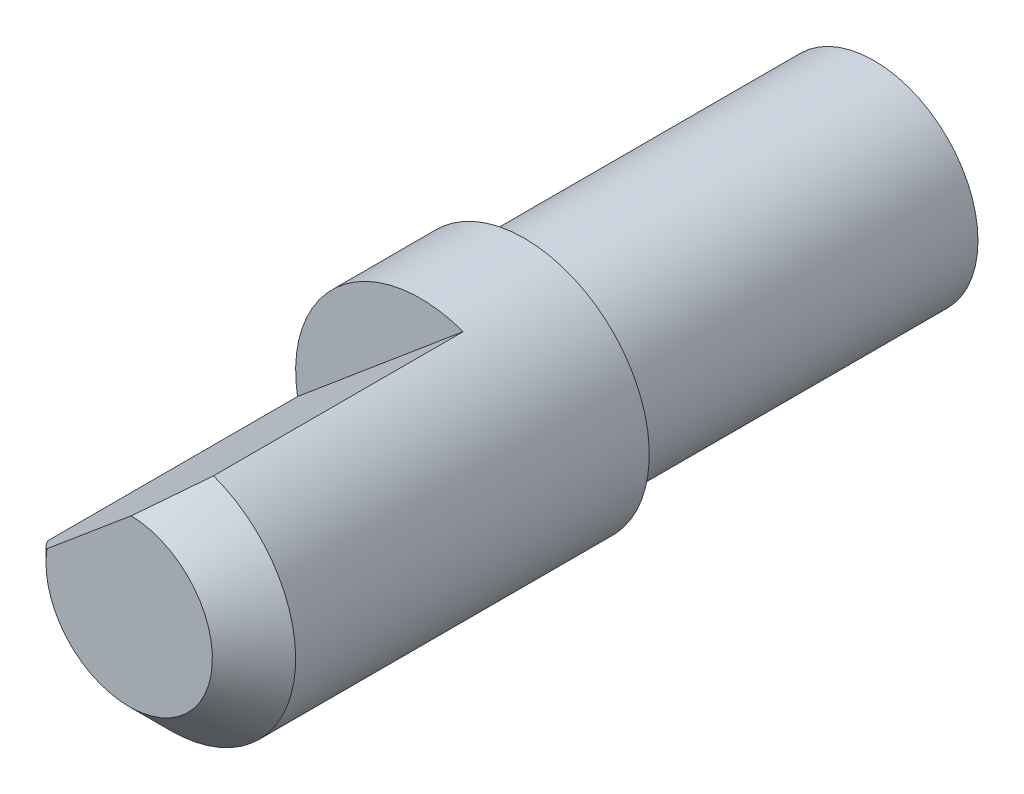
ISO-10303-21;
HEADER;
FILE_DESCRIPTION(('STEP AP214'),'2;1');
FILE_NAME('part.step','',(''),(''),'','','');
FILE_SCHEMA(('AUTOMOTIVE_DESIGN { 1 0 10303 214 1 1 1 1 }'));
ENDSEC;
DATA;
#1=APPLICATION_CONTEXT('core data for automotive mechanical design processes');
#2=APPLICATION_PROTOCOL_DEFINITION('international standard','automotive_design',2000,#1);
#3=PRODUCT_CONTEXT('',#1,'mechanical');
#4=PRODUCT('Part','Part','',(#3));
#5=PRODUCT_RELATED_PRODUCT_CATEGORY('part','',(#4));
#6=PRODUCT_DEFINITION_FORMATION('','',#4);
#7=PRODUCT_DEFINITION_CONTEXT('part definition',#1,'design');
#8=PRODUCT_DEFINITION('design','',#6,#7);
#9=PRODUCT_DEFINITION_SHAPE('','',#8);
#10=(LENGTH_UNIT() NAMED_UNIT(*) SI_UNIT(.MILLI.,.METRE.));
#11=(NAMED_UNIT(*) PLANE_ANGLE_UNIT() SI_UNIT($,.RADIAN.));
#12=(NAMED_UNIT(*) SI_UNIT($,.STERADIAN.) SOLID_ANGLE_UNIT());
#13=UNCERTAINTY_MEASURE_WITH_UNIT(LENGTH_MEASURE(1.E-05),#10,'distance_accuracy_value','');
#14=(GEOMETRIC_REPRESENTATION_CONTEXT(3) GLOBAL_UNCERTAINTY_ASSIGNED_CONTEXT((#13)) GLOBAL_UNIT_ASSIGNED_CONTEXT((#10,
#11,#12)) REPRESENTATION_CONTEXT('',''));
#15=CARTESIAN_POINT('',(0.,0.,0.));
#16=DIRECTION('',(0.,0.,1.));
#17=DIRECTION('',(1.,0.,0.));
#18=AXIS2_PLACEMENT_3D('',#15,#16,#17);
#19=CARTESIAN_POINT('',(0.,0.,-2.9));
#20=DIRECTION('',(0.,0.,-1.));
#21=DIRECTION('',(-1.,0.,0.));
#22=AXIS2_PLACEMENT_3D('',#19,#20,#21);
#23=PLANE('',#22);
#24=CARTESIAN_POINT('',(0.,0.,-2.9));
#25=DIRECTION('',(0.,0.,-1.));
#26=DIRECTION('',(0.,-1.,0.));
#27=AXIS2_PLACEMENT_3D('',#24,#25,#26);
#28=CIRCLE('',#27,2.5);
#29=CARTESIAN_POINT('',(0.,-2.5,-2.9));
#30=VERTEX_POINT('',#29);
#31=EDGE_CURVE('E11',#30,#30,#28,.T.);
#32=ORIENTED_EDGE('',*,*,#31,.T.);
#33=EDGE_LOOP('',(#32));
#34=FACE_BOUND('',#33,.T.);
#35=ADVANCED_FACE('F17',(#34),#23,.T.);
#36=CARTESIAN_POINT('',(0.,0.,5.5));
#37=DIRECTION('',(0.,0.,-1.));
#38=DIRECTION('',(0.,-1.,0.));
#39=AXIS2_PLACEMENT_3D('',#36,#37,#38);
#40=CYLINDRICAL_SURFACE('',#39,2.5);
#41=CARTESIAN_POINT('',(0.,0.,5.5));
#42=DIRECTION('',(0.,0.,-1.));
#43=DIRECTION('',(0.,-1.,0.));
#44=AXIS2_PLACEMENT_3D('',#41,#42,#43);
#45=CIRCLE('',#44,2.5);
#46=CARTESIAN_POINT('',(0.,-2.5,5.5));
#47=VERTEX_POINT('',#46);
#48=EDGE_CURVE('E76',#47,#47,#45,.T.);
#49=ORIENTED_EDGE('',*,*,#48,.T.);
#50=CARTESIAN_POINT('',(0.,-2.5,5.5));
#51=CARTESIAN_POINT('',(0.,-2.5,-2.9));
#52=(BOUNDED_CURVE() B_SPLINE_CURVE(1,(#50,#51),.UNSPECIFIED.,.F.,
.F.) B_SPLINE_CURVE_WITH_KNOTS((2,2),(0.,8.4),
.UNSPECIFIED.) CURVE() GEOMETRIC_REPRESENTATION_ITEM() RATIONAL_B_SPLINE_CURVE((1.,1.)) REPRESENTATION_ITEM(''));
#53=EDGE_CURVE('E20',#47,#30,#52,.T.);
#54=ORIENTED_EDGE('',*,*,#53,.T.);
#55=ORIENTED_EDGE('',*,*,#31,.F.);
#56=ORIENTED_EDGE('',*,*,#53,.F.);
#57=EDGE_LOOP('',(#49,#54,#55,#56));
#58=FACE_BOUND('',#57,.T.);
#59=ADVANCED_FACE('F127',(#58),#40,.T.);
#60=CARTESIAN_POINT('',(0.,0.,5.5));
#61=DIRECTION('',(0.,0.,-1.));
#62=DIRECTION('',(-1.,0.,0.));
#63=AXIS2_PLACEMENT_3D('',#60,#61,#62);
#64=PLANE('',#63);
#65=ORIENTED_EDGE('',*,*,#48,.F.);
#66=EDGE_LOOP('',(#65));
#67=FACE_BOUND('',#66,.T.);
#68=CARTESIAN_POINT('',(0.,0.,5.5));
#69=DIRECTION('',(0.,0.,-1.));
#70=DIRECTION('',(0.,-1.,0.));
#71=AXIS2_PLACEMENT_3D('',#68,#69,#70);
#72=CIRCLE('',#71,3.);
#73=CARTESIAN_POINT('',(0.,-3.,5.5));
#74=VERTEX_POINT('',#73);
#75=EDGE_CURVE('E90',#74,#74,#72,.T.);
#76=ORIENTED_EDGE('',*,*,#75,.T.);
#77=EDGE_LOOP('',(#76));
#78=FACE_BOUND('',#77,.T.);
#79=ADVANCED_FACE('F129',(#67,#78),#64,.T.);
#80=CARTESIAN_POINT('',(-2.954414996841,-0.520991388066,8.));
#81=DIRECTION('',(0.642787609686799,-0.76604444311876,0.));
#82=DIRECTION('',(0.,0.,-1.));
#83=AXIS2_PLACEMENT_3D('',#80,#81,#82);
#84=PLANE('',#83);
#85=DIRECTION('',(0.,0.,-1.));
#86=VECTOR('',#85,1.);
#87=CARTESIAN_POINT('',(1.026105138494,2.819061589387,14.));
#88=LINE('',#87,#86);
#89=CARTESIAN_POINT('',(1.026105138494,2.819061589387,14.));
#90=VERTEX_POINT('',#89);
#91=CARTESIAN_POINT('',(1.026105138494,2.819061589387,8.));
#92=VERTEX_POINT('',#91);
#93=EDGE_CURVE('E72',#90,#92,#88,.T.);
#94=ORIENTED_EDGE('',*,*,#93,.T.);
#95=DIRECTION('',(0.76604444311876,0.642787609686799,0.));
#96=VECTOR('',#95,1.);
#97=CARTESIAN_POINT('',(-2.954414996841,-0.520991388066,8.));
#98=LINE('',#97,#96);
#99=CARTESIAN_POINT('',(-2.954414996841,-0.520991388066,8.));
#100=VERTEX_POINT('',#99);
#101=EDGE_CURVE('E62',#100,#92,#98,.T.);
#102=ORIENTED_EDGE('',*,*,#101,.F.);
#103=DIRECTION('',(0.,0.,-1.));
#104=VECTOR('',#103,1.);
#105=CARTESIAN_POINT('',(-2.954414996841,-0.520991388066,14.));
#106=LINE('',#105,#104);
#107=CARTESIAN_POINT('',(-2.954414996841,-0.520991388066,14.));
#108=VERTEX_POINT('',#107);
#109=EDGE_CURVE('E68',#108,#100,#106,.T.);
#110=ORIENTED_EDGE('',*,*,#109,.F.);
#111=CARTESIAN_POINT('',(-1.977572263141,0.2986769895,15.));
#112=CARTESIAN_POINT('',(-1.987024621891,0.290745518759,14.991838014281));
#113=CARTESIAN_POINT('',(-2.006066758987,0.274767268545,14.975266044096));
#114=CARTESIAN_POINT('',(-2.034768065458,0.250684012871,14.949909885964));
#115=CARTESIAN_POINT('',(-2.064064971579,0.22610098975,14.923650767874));
#116=CARTESIAN_POINT('',(-2.093952910285,0.201022031405,14.896482954965));
#117=CARTESIAN_POINT('',(-2.128590398733,0.171957727624,14.864565944215));
#118=CARTESIAN_POINT('',(-2.168078920685,0.138822923418,14.827601578181));
#119=CARTESIAN_POINT('',(-2.212689454939,0.101390240578,14.785109382125));
#120=CARTESIAN_POINT('',(-2.255059984683,0.06583714469811,14.744073850808));
#121=CARTESIAN_POINT('',(-2.295246307179,0.03211681631343,14.70460273222));
#122=CARTESIAN_POINT('',(-2.333640699302,-9.990395691151E-05,14.666436921482));
#123=CARTESIAN_POINT('',(-2.373598926837,-0.03362883794386,14.626242815471));
#124=CARTESIAN_POINT('',(-2.415451720731,-0.06874750186411,14.583652184126));
#125=CARTESIAN_POINT('',(-2.458840058676,-0.105154640231,14.538997021514));
#126=CARTESIAN_POINT('',(-2.504093184455,-0.143126521382,14.491905597507));
#127=CARTESIAN_POINT('',(-2.550517632736,-0.182081258812,14.443075991601));
#128=CARTESIAN_POINT('',(-2.598111426199,-0.222017193353,14.39250257868));
#129=CARTESIAN_POINT('',(-2.64653673841,-0.262650854969,14.340543631966));
#130=CARTESIAN_POINT('',(-2.696135158364,-0.304268870859,14.286830547836));
#131=CARTESIAN_POINT('',(-2.746570557185,-0.346589195408,14.231725932371));
#132=CARTESIAN_POINT('',(-2.797850333292,-0.389618036626,14.175226854558));
#133=CARTESIAN_POINT('',(-2.849643338164,-0.433077527912,14.117708303951));
#134=CARTESIAN_POINT('',(-2.901955360635,-0.476972526674,14.05917696168));
#135=CARTESIAN_POINT('',(-2.936888600557,-0.506284995408,14.019813840517));
#136=CARTESIAN_POINT('',(-2.954414996841,-0.520991388066,14.));
#137=(BOUNDED_CURVE() B_SPLINE_CURVE(3,(#111,#112,#113,#114,#115,#116,#117,#118,#119,#120,#121,
#122,#123,#124,#125,#126,#127,#128,#129,#130,#131,#132,#133,#134,#135,#136),.UNSPECIFIED.,.F.,
.F.) B_SPLINE_CURVE_WITH_KNOTS((4,1,1,1,1,1,1,1,1,1,1,1,1,1,1,1,1,1,1,1,1,1,1,4),(0.,
0.02735677579742,0.05524945717209,0.08367968204925,0.113177497349,0.143209443885,0.186083908146,
0.230548990335,0.276603458522,0.313522379443,0.352024663816,0.393164389255,0.435355665449,
0.480180319273,0.526583293968,0.575090971267,0.624122148505,0.674740187389,0.726421371532,
0.779706782989,0.83353833144,0.888463830164,0.943949653387,1.),
.UNSPECIFIED.) CURVE() GEOMETRIC_REPRESENTATION_ITEM() RATIONAL_B_SPLINE_CURVE((1.,1.,1.,1.,1.,
1.,1.,1.,1.,1.,1.,1.,1.,1.,1.,1.,1.,1.,1.,1.,1.,1.,1.,1.,1.,1.)) REPRESENTATION_ITEM(''));
#138=CARTESIAN_POINT('',(-1.977572263141,0.2986769895,15.));
#139=VERTEX_POINT('',#138);
#140=EDGE_CURVE('E174',#139,#108,#137,.T.);
#141=ORIENTED_EDGE('',*,*,#140,.F.);
#142=DIRECTION('',(0.76604444311876,0.642787609686799,0.));
#143=VECTOR('',#142,1.);
#144=CARTESIAN_POINT('',(-1.977572263141,0.2986769895,15.));
#145=LINE('',#144,#143);
#146=CARTESIAN_POINT('',(0.0492624047928,1.999393211821,15.));
#147=VERTEX_POINT('',#146);
#148=EDGE_CURVE('E163',#139,#147,#145,.T.);
#149=ORIENTED_EDGE('',*,*,#148,.T.);
#150=CARTESIAN_POINT('',(0.0492624047928,1.999393211821,15.));
#151=CARTESIAN_POINT('',(0.05871476354326,2.007324682562,14.991838014281));
#152=CARTESIAN_POINT('',(0.077756900639,2.023302932776,14.975266044096));
#153=CARTESIAN_POINT('',(0.10645820711,2.04738618845,14.949909885964));
#154=CARTESIAN_POINT('',(0.135755113231,2.07196921157,14.923650767874));
#155=CARTESIAN_POINT('',(0.165643051937,2.097048169916,14.896482954965));
#156=CARTESIAN_POINT('',(0.200280540385,2.126112473697,14.864565944215));
#157=CARTESIAN_POINT('',(0.239769062338,2.159247277903,14.827601578181));
#158=CARTESIAN_POINT('',(0.284379596592,2.196679960742,14.785109382125));
#159=CARTESIAN_POINT('',(0.326750126335,2.232233056623,14.744073850808));
#160=CARTESIAN_POINT('',(0.366936448831,2.265953385007,14.70460273222));
#161=CARTESIAN_POINT('',(0.405330840955,2.298170105278,14.666436921482));
#162=CARTESIAN_POINT('',(0.445289068489,2.331699039265,14.626242815471));
#163=CARTESIAN_POINT('',(0.487141862383,2.366817703185,14.583652184126));
#164=CARTESIAN_POINT('',(0.530530200329,2.403224841552,14.538997021514));
#165=CARTESIAN_POINT('',(0.575783326107,2.441196722703,14.491905597507));
#166=CARTESIAN_POINT('',(0.622207774389,2.480151460133,14.443075991601));
#167=CARTESIAN_POINT('',(0.669801567851,2.520087394674,14.39250257868));
#168=CARTESIAN_POINT('',(0.718226880062,2.56072105629,14.340543631966));
#169=CARTESIAN_POINT('',(0.767825300016,2.60233907218,14.286830547836));
#170=CARTESIAN_POINT('',(0.818260698837,2.644659396729,14.231725932371));
#171=CARTESIAN_POINT('',(0.869540474944,2.687688237947,14.175226854558));
#172=CARTESIAN_POINT('',(0.921333479816,2.731147729233,14.117708303951));
#173=CARTESIAN_POINT('',(0.973645502288,2.775042727995,14.05917696168));
#174=CARTESIAN_POINT('',(1.008578742209,2.804355196729,14.019813840517));
#175=CARTESIAN_POINT('',(1.026105138494,2.819061589387,14.));
#176=(BOUNDED_CURVE() B_SPLINE_CURVE(3,(#150,#151,#152,#153,#154,#155,#156,#157,#158,#159,#160,
#161,#162,#163,#164,#165,#166,#167,#168,#169,#170,#171,#172,#173,#174,#175),.UNSPECIFIED.,.F.,
.F.) B_SPLINE_CURVE_WITH_KNOTS((4,1,1,1,1,1,1,1,1,1,1,1,1,1,1,1,1,1,1,1,1,1,1,4),(0.,
0.02735677579742,0.05524945717209,0.08367968204924,0.113177497349,0.143209443885,0.186083908146,
0.230548990335,0.276603458522,0.313522379443,0.352024663816,0.393164389255,0.435355665449,
0.480180319273,0.526583293968,0.575090971267,0.624122148505,0.674740187389,0.726421371532,
0.779706782989,0.83353833144,0.888463830164,0.943949653387,1.),
.UNSPECIFIED.) CURVE() GEOMETRIC_REPRESENTATION_ITEM() RATIONAL_B_SPLINE_CURVE((1.,1.,1.,1.,1.,
1.,1.,1.,1.,1.,1.,1.,1.,1.,1.,1.,1.,1.,1.,1.,1.,1.,1.,1.,1.,1.)) REPRESENTATION_ITEM(''));
#177=EDGE_CURVE('E103',#147,#90,#176,.T.);
#178=ORIENTED_EDGE('',*,*,#177,.T.);
#179=EDGE_LOOP('',(#94,#102,#110,#141,#149,#178));
#180=FACE_BOUND('',#179,.T.);
#181=ADVANCED_FACE('F64',(#180),#84,.F.);
#182=CARTESIAN_POINT('',(0.,0.,8.));
#183=DIRECTION('',(0.,0.,1.));
#184=DIRECTION('',(0.,-1.,0.));
#185=AXIS2_PLACEMENT_3D('',#182,#183,#184);
#186=PLANE('',#185);
#187=CARTESIAN_POINT('',(0.,0.,8.));
#188=DIRECTION('',(0.,0.,-1.));
#189=DIRECTION('',(-0.984804998947112,-0.17366379602202,0.));
#190=AXIS2_PLACEMENT_3D('',#187,#188,#189);
#191=CIRCLE('',#190,3.);
#192=EDGE_CURVE('E78',#100,#92,#191,.T.);
#193=ORIENTED_EDGE('',*,*,#192,.F.);
#194=ORIENTED_EDGE('',*,*,#101,.T.);
#195=EDGE_LOOP('',(#193,#194));
#196=FACE_BOUND('',#195,.T.);
#197=ADVANCED_FACE('F79',(#196),#186,.T.);
#198=CARTESIAN_POINT('',(0.,0.,14.));
#199=DIRECTION('',(0.,0.,-1.));
#200=DIRECTION('',(0.,-1.,0.));
#201=AXIS2_PLACEMENT_3D('',#198,#199,#200);
#202=CYLINDRICAL_SURFACE('',#201,3.);
#203=CARTESIAN_POINT('',(0.,0.,14.));
#204=DIRECTION('',(0.,0.,-1.));
#205=DIRECTION('',(0.34203504616505,0.939687196462138,0.));
#206=AXIS2_PLACEMENT_3D('',#203,#204,#205);
#207=CIRCLE('',#206,3.);
#208=CARTESIAN_POINT('',(0.,-3.,14.));
#209=VERTEX_POINT('',#208);
#210=EDGE_CURVE('E100',#90,#209,#207,.T.);
#211=ORIENTED_EDGE('',*,*,#210,.T.);
#212=CARTESIAN_POINT('',(0.,-3.,14.));
#213=CARTESIAN_POINT('',(0.,-3.,5.5));
#214=(BOUNDED_CURVE() B_SPLINE_CURVE(1,(#212,#213),.UNSPECIFIED.,.F.,
.F.) B_SPLINE_CURVE_WITH_KNOTS((2,2),(0.,8.5),
.UNSPECIFIED.) CURVE() GEOMETRIC_REPRESENTATION_ITEM() RATIONAL_B_SPLINE_CURVE((1.,1.)) REPRESENTATION_ITEM(''));
#215=EDGE_CURVE('E96',#209,#74,#214,.T.);
#216=ORIENTED_EDGE('',*,*,#215,.T.);
#217=ORIENTED_EDGE('',*,*,#75,.F.);
#218=ORIENTED_EDGE('',*,*,#215,.F.);
#219=CARTESIAN_POINT('',(0.,0.,14.));
#220=DIRECTION('',(0.,0.,-1.));
#221=DIRECTION('',(0.,-1.,0.));
#222=AXIS2_PLACEMENT_3D('',#219,#220,#221);
#223=CIRCLE('',#222,3.);
#224=EDGE_CURVE('E87',#209,#108,#223,.T.);
#225=ORIENTED_EDGE('',*,*,#224,.T.);
#226=ORIENTED_EDGE('',*,*,#109,.T.);
#227=ORIENTED_EDGE('',*,*,#192,.T.);
#228=ORIENTED_EDGE('',*,*,#93,.F.);
#229=EDGE_LOOP('',(#211,#216,#217,#218,#225,#226,#227,#228));
#230=FACE_BOUND('',#229,.T.);
#231=ADVANCED_FACE('F84',(#230),#202,.T.);
#232=CARTESIAN_POINT('',(0.,0.,14.5));
#233=DIRECTION('',(0.,0.,-1.));
#234=DIRECTION('',(0.,-1.,0.));
#235=AXIS2_PLACEMENT_3D('',#232,#233,#234);
#236=CONICAL_SURFACE('',#235,2.5,0.785398163397);
#237=ORIENTED_EDGE('',*,*,#140,.T.);
#238=ORIENTED_EDGE('',*,*,#224,.F.);
#239=ORIENTED_EDGE('',*,*,#210,.F.);
#240=ORIENTED_EDGE('',*,*,#177,.F.);
#241=CARTESIAN_POINT('',(0.,0.,15.));
#242=DIRECTION('',(0.,0.,-1.));
#243=DIRECTION('',(0.0246312023964066,0.999696605910267,0.));
#244=AXIS2_PLACEMENT_3D('',#241,#242,#243);
#245=CIRCLE('',#244,2.);
#246=EDGE_CURVE('E166',#147,#139,#245,.T.);
#247=ORIENTED_EDGE('',*,*,#246,.T.);
#248=EDGE_LOOP('',(#237,#238,#239,#240,#247));
#249=FACE_BOUND('',#248,.T.);
#250=ADVANCED_FACE('F147',(#249),#236,.T.);
#251=CARTESIAN_POINT('',(0.,0.,15.));
#252=DIRECTION('',(0.,0.,1.));
#253=DIRECTION('',(0.,-1.,0.));
#254=AXIS2_PLACEMENT_3D('',#251,#252,#253);
#255=PLANE('',#254);
#256=ORIENTED_EDGE('',*,*,#148,.F.);
#257=ORIENTED_EDGE('',*,*,#246,.F.);
#258=EDGE_LOOP('',(#256,#257));
#259=FACE_BOUND('',#258,.T.);
#260=ADVANCED_FACE('F151',(#259),#255,.T.);
#261=CLOSED_SHELL('',(#35,#59,#79,#181,#197,#231,#250,#260));
#262=MANIFOLD_SOLID_BREP('B1',#261);
#263=ADVANCED_BREP_SHAPE_REPRESENTATION('',(#18,#262),#14);
#264=SHAPE_DEFINITION_REPRESENTATION(#9,#263);
ENDSEC;
END-ISO-10303-21;
